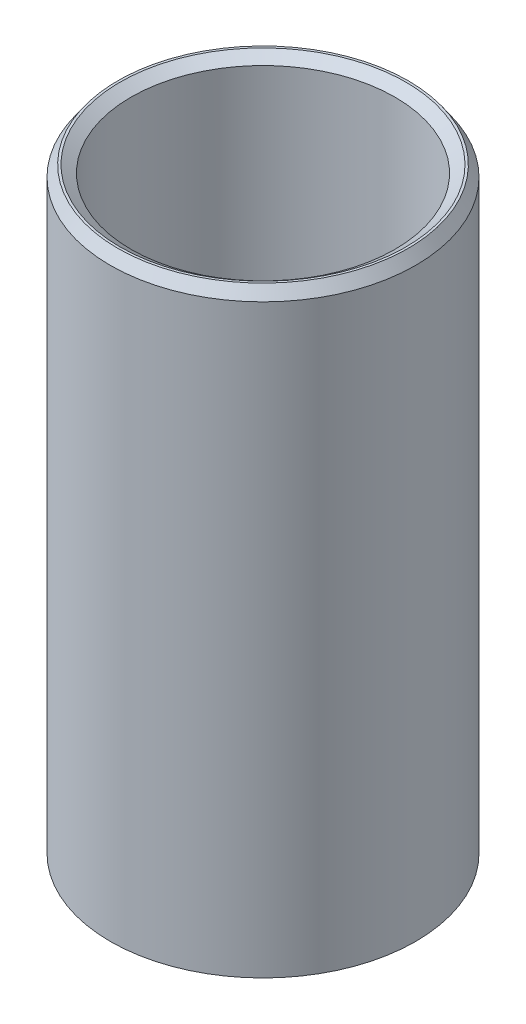
ISO-10303-21;
HEADER;
FILE_DESCRIPTION(('STEP AP214'),'2;1');
FILE_NAME('part.step','',(''),(''),'','','');
FILE_SCHEMA(('AUTOMOTIVE_DESIGN { 1 0 10303 214 1 1 1 1 }'));
ENDSEC;
DATA;
#1=APPLICATION_CONTEXT('core data for automotive mechanical design processes');
#2=APPLICATION_PROTOCOL_DEFINITION('international standard','automotive_design',2000,#1);
#3=PRODUCT_CONTEXT('',#1,'mechanical');
#4=PRODUCT('Part','Part','',(#3));
#5=PRODUCT_RELATED_PRODUCT_CATEGORY('part','',(#4));
#6=PRODUCT_DEFINITION_FORMATION('','',#4);
#7=PRODUCT_DEFINITION_CONTEXT('part definition',#1,'design');
#8=PRODUCT_DEFINITION('design','',#6,#7);
#9=PRODUCT_DEFINITION_SHAPE('','',#8);
#10=(LENGTH_UNIT() NAMED_UNIT(*) SI_UNIT(.MILLI.,.METRE.));
#11=(NAMED_UNIT(*) PLANE_ANGLE_UNIT() SI_UNIT($,.RADIAN.));
#12=(NAMED_UNIT(*) SI_UNIT($,.STERADIAN.) SOLID_ANGLE_UNIT());
#13=UNCERTAINTY_MEASURE_WITH_UNIT(LENGTH_MEASURE(1.E-05),#10,'distance_accuracy_value','');
#14=(GEOMETRIC_REPRESENTATION_CONTEXT(3) GLOBAL_UNCERTAINTY_ASSIGNED_CONTEXT((#13)) GLOBAL_UNIT_ASSIGNED_CONTEXT((#10,
#11,#12)) REPRESENTATION_CONTEXT('',''));
#15=CARTESIAN_POINT('',(0.,0.,0.));
#16=DIRECTION('',(0.,0.,1.));
#17=DIRECTION('',(1.,0.,0.));
#18=AXIS2_PLACEMENT_3D('',#15,#16,#17);
#19=CARTESIAN_POINT('',(0.,217.49006375391,0.));
#20=DIRECTION('',(0.,-1.,0.));
#21=DIRECTION('',(0.,0.,-1.));
#22=AXIS2_PLACEMENT_3D('',#19,#20,#21);
#23=CYLINDRICAL_SURFACE('',#22,55.);
#24=CARTESIAN_POINT('',(0.,2.7091569463687,0.));
#25=DIRECTION('',(0.,1.,0.));
#26=DIRECTION('',(0.,0.,1.));
#27=AXIS2_PLACEMENT_3D('',#24,#25,#26);
#28=CIRCLE('',#27,55.);
#29=CARTESIAN_POINT('',(0.,2.70915694636867,-55.));
#30=VERTEX_POINT('',#29);
#31=EDGE_CURVE('E10',#30,#30,#28,.T.);
#32=CARTESIAN_POINT('',(0.,213.551168218493,0.));
#33=DIRECTION('',(0.,1.,0.));
#34=DIRECTION('',(0.,0.,1.));
#35=AXIS2_PLACEMENT_3D('',#32,#33,#34);
#36=CIRCLE('',#35,55.);
#37=CARTESIAN_POINT('',(0.,213.551168218493,-55.));
#38=VERTEX_POINT('',#37);
#39=EDGE_CURVE('E50',#38,#38,#36,.F.);
#40=CARTESIAN_POINT('',(0.,2.70915694636867,-55.));
#41=CARTESIAN_POINT('',(0.,4.90542789711996,-55.));
#42=CARTESIAN_POINT('',(0.,7.10169884787125,-55.));
#43=CARTESIAN_POINT('',(0.,11.4942407493738,-55.));
#44=CARTESIAN_POINT('',(0.,13.6905117001252,-55.));
#45=CARTESIAN_POINT('',(0.,18.0830536016277,-55.));
#46=CARTESIAN_POINT('',(0.,20.279324552379,-55.));
#47=CARTESIAN_POINT('',(0.,24.6718664538816,-55.));
#48=CARTESIAN_POINT('',(0.,26.8681374046329,-55.));
#49=CARTESIAN_POINT('',(0.,31.2606793061355,-55.));
#50=CARTESIAN_POINT('',(0.,33.4569502568868,-55.));
#51=CARTESIAN_POINT('',(0.,37.8494921583894,-55.));
#52=CARTESIAN_POINT('',(0.,40.0457631091407,-55.));
#53=CARTESIAN_POINT('',(0.,44.4383050106433,-55.));
#54=CARTESIAN_POINT('',(0.,46.6345759613946,-55.));
#55=CARTESIAN_POINT('',(0.,51.0271178628972,-55.));
#56=CARTESIAN_POINT('',(0.,53.2233888136485,-55.));
#57=CARTESIAN_POINT('',(0.,57.6159307151511,-55.));
#58=CARTESIAN_POINT('',(0.,59.8122016659024,-55.));
#59=CARTESIAN_POINT('',(0.,64.2047435674049,-55.));
#60=CARTESIAN_POINT('',(0.,66.4010145181563,-55.));
#61=CARTESIAN_POINT('',(0.,70.7935564196589,-55.));
#62=CARTESIAN_POINT('',(0.,72.9898273704101,-55.));
#63=CARTESIAN_POINT('',(0.,77.3823692719127,-55.));
#64=CARTESIAN_POINT('',(0.,79.578640222664,-55.));
#65=CARTESIAN_POINT('',(0.,83.9711821241666,-55.));
#66=CARTESIAN_POINT('',(0.,86.1674530749179,-55.));
#67=CARTESIAN_POINT('',(0.,90.5599949764205,-55.));
#68=CARTESIAN_POINT('',(0.,92.7562659271718,-55.));
#69=CARTESIAN_POINT('',(0.,97.1488078286744,-55.));
#70=CARTESIAN_POINT('',(0.,99.3450787794257,-55.));
#71=CARTESIAN_POINT('',(0.,103.737620680928,-55.));
#72=CARTESIAN_POINT('',(0.,105.93389163168,-55.));
#73=CARTESIAN_POINT('',(0.,110.326433533182,-55.));
#74=CARTESIAN_POINT('',(0.,112.522704483933,-55.));
#75=CARTESIAN_POINT('',(0.,116.915246385436,-55.));
#76=CARTESIAN_POINT('',(0.,119.111517336187,-55.));
#77=CARTESIAN_POINT('',(0.,123.50405923769,-55.));
#78=CARTESIAN_POINT('',(0.,125.700330188441,-55.));
#79=CARTESIAN_POINT('',(0.,130.092872089944,-55.));
#80=CARTESIAN_POINT('',(0.,132.289143040695,-55.));
#81=CARTESIAN_POINT('',(0.,136.681684942198,-55.));
#82=CARTESIAN_POINT('',(0.,138.877955892949,-55.));
#83=CARTESIAN_POINT('',(0.,143.270497794452,-55.));
#84=CARTESIAN_POINT('',(0.,145.466768745203,-55.));
#85=CARTESIAN_POINT('',(0.,149.859310646705,-55.));
#86=CARTESIAN_POINT('',(0.,152.055581597457,-55.));
#87=CARTESIAN_POINT('',(0.,156.448123498959,-55.));
#88=CARTESIAN_POINT('',(0.,158.644394449711,-55.));
#89=CARTESIAN_POINT('',(0.,163.036936351213,-55.));
#90=CARTESIAN_POINT('',(0.,165.233207301965,-55.));
#91=CARTESIAN_POINT('',(0.,169.625749203467,-55.));
#92=CARTESIAN_POINT('',(0.,171.822020154218,-55.));
#93=CARTESIAN_POINT('',(0.,176.214562055721,-55.));
#94=CARTESIAN_POINT('',(0.,178.410833006472,-55.));
#95=CARTESIAN_POINT('',(0.,182.803374907975,-55.));
#96=CARTESIAN_POINT('',(0.,184.999645858726,-55.));
#97=CARTESIAN_POINT('',(0.,189.392187760229,-55.));
#98=CARTESIAN_POINT('',(0.,191.58845871098,-55.));
#99=CARTESIAN_POINT('',(0.,195.981000612483,-55.));
#100=CARTESIAN_POINT('',(0.,198.177271563234,-55.));
#101=CARTESIAN_POINT('',(0.,202.569813464737,-55.));
#102=CARTESIAN_POINT('',(0.,204.766084415488,-55.));
#103=CARTESIAN_POINT('',(0.,209.15862631699,-55.));
#104=CARTESIAN_POINT('',(0.,211.354897267742,-55.));
#105=CARTESIAN_POINT('',(0.,213.551168218493,-55.));
#106=B_SPLINE_CURVE_WITH_KNOTS('',3,(#40,#41,#42,#43,#44,#45,#46,#47,#48,#49,#50,#51,#52,#53,
#54,#55,#56,#57,#58,#59,#60,#61,#62,#63,#64,#65,#66,#67,#68,#69,#70,#71,#72,#73,#74,#75,#76,#77,
#78,#79,#80,#81,#82,#83,#84,#85,#86,#87,#88,#89,#90,#91,#92,#93,#94,#95,#96,#97,#98,#99,#100,
#101,#102,#103,#104,#105),.UNSPECIFIED.,.F.,.F.,(4,2,2,2,2,2,2,2,2,2,2,2,2,2,2,2,2,2,2,2,2,2,2,
2,2,2,2,2,2,2,2,2,4),(0.,6.58881285225388,13.1776257045078,19.7664385567617,26.3552514090155,
32.9440642612694,39.5328771135233,46.1216899657772,52.7105028180311,59.299315670285,
65.8881285225389,72.4769413747928,79.0657542270467,85.6545670793005,92.2433799315544,
98.8321927838083,105.421005636062,112.009818488316,118.59863134057,125.187444192824,
131.776257045078,138.365069897332,144.953882749586,151.542695601839,158.131508454093,
164.720321306347,171.309134158601,177.897947010855,184.486759863109,191.075572715363,
197.664385567617,204.253198419871,210.842011272124),.UNSPECIFIED.);
#107=EDGE_CURVE('BSEAM39',#30,#38,#106,.T.);
#108=ORIENTED_EDGE('',*,*,#31,.T.);
#109=ORIENTED_EDGE('',*,*,#39,.T.);
#110=ORIENTED_EDGE('',*,*,#107,.T.);
#111=ORIENTED_EDGE('',*,*,#107,.F.);
#112=EDGE_LOOP('',(#108,#110,#109,#111));
#113=FACE_BOUND('',#112,.T.);
#114=ADVANCED_FACE('F39',(#113),#23,.T.);
#115=CARTESIAN_POINT('',(0.,217.49006375391,0.));
#116=DIRECTION('',(0.,1.,0.));
#117=DIRECTION('',(0.,0.,1.));
#118=AXIS2_PLACEMENT_3D('',#115,#116,#117);
#119=PLANE('',#118);
#120=CARTESIAN_POINT('',(0.,217.49006375391,0.));
#121=DIRECTION('',(0.,1.,0.));
#122=DIRECTION('',(0.,0.,1.));
#123=AXIS2_PLACEMENT_3D('',#120,#121,#122);
#124=CIRCLE('',#123,51.4443762123566);
#125=CARTESIAN_POINT('',(0.,217.49006375391,51.4443762123566));
#126=VERTEX_POINT('',#125);
#127=EDGE_CURVE('E58',#126,#126,#124,.F.);
#128=ORIENTED_EDGE('',*,*,#127,.T.);
#129=EDGE_LOOP('',(#128));
#130=FACE_BOUND('',#129,.T.);
#131=CARTESIAN_POINT('',(0.,217.49006375391,0.));
#132=DIRECTION('',(0.,1.,0.));
#133=DIRECTION('',(0.,0.,1.));
#134=AXIS2_PLACEMENT_3D('',#131,#132,#133);
#135=CIRCLE('',#134,52.2908430536315);
#136=CARTESIAN_POINT('',(0.,217.49006375391,52.2908430536315));
#137=VERTEX_POINT('',#136);
#138=EDGE_CURVE('E61',#137,#137,#135,.T.);
#139=ORIENTED_EDGE('',*,*,#138,.T.);
#140=EDGE_LOOP('',(#139));
#141=FACE_BOUND('',#140,.T.);
#142=ADVANCED_FACE('F88',(#130,#141),#119,.T.);
#143=CARTESIAN_POINT('',(0.,0.,0.));
#144=DIRECTION('',(0.,1.,0.));
#145=DIRECTION('',(0.,0.,1.));
#146=AXIS2_PLACEMENT_3D('',#143,#144,#145);
#147=PLANE('',#146);
#148=CARTESIAN_POINT('',(0.,0.,0.));
#149=DIRECTION('',(0.,1.,0.));
#150=DIRECTION('',(0.,0.,1.));
#151=AXIS2_PLACEMENT_3D('',#148,#149,#150);
#152=CIRCLE('',#151,50.2146376233077);
#153=CARTESIAN_POINT('',(0.,0.,50.2146376233077));
#154=VERTEX_POINT('',#153);
#155=EDGE_CURVE('E51',#154,#154,#152,.T.);
#156=ORIENTED_EDGE('',*,*,#155,.T.);
#157=EDGE_LOOP('',(#156));
#158=FACE_BOUND('',#157,.T.);
#159=CARTESIAN_POINT('',(0.,0.,0.));
#160=DIRECTION('',(0.,1.,0.));
#161=DIRECTION('',(0.,0.,1.));
#162=AXIS2_PLACEMENT_3D('',#159,#160,#161);
#163=CIRCLE('',#162,51.0611044645824);
#164=CARTESIAN_POINT('',(0.,0.,51.0611044645824));
#165=VERTEX_POINT('',#164);
#166=EDGE_CURVE('E54',#165,#165,#163,.F.);
#167=ORIENTED_EDGE('',*,*,#166,.T.);
#168=EDGE_LOOP('',(#167));
#169=FACE_BOUND('',#168,.T.);
#170=ADVANCED_FACE('F83',(#158,#169),#147,.F.);
#171=CARTESIAN_POINT('',(0.,217.49006375391,0.));
#172=DIRECTION('',(0.,-1.,0.));
#173=DIRECTION('',(0.,0.,-1.));
#174=AXIS2_PLACEMENT_3D('',#171,#172,#173);
#175=CYLINDRICAL_SURFACE('',#174,47.5054806769391);
#176=CARTESIAN_POINT('',(0.,214.780906807542,0.));
#177=DIRECTION('',(0.,1.,0.));
#178=DIRECTION('',(0.,0.,1.));
#179=AXIS2_PLACEMENT_3D('',#176,#177,#178);
#180=CIRCLE('',#179,47.5054806769391);
#181=CARTESIAN_POINT('',(0.,214.780906807542,-47.5054806769391));
#182=VERTEX_POINT('',#181);
#183=EDGE_CURVE('E67',#182,#182,#180,.T.);
#184=CARTESIAN_POINT('',(0.,3.93889553541737,0.));
#185=DIRECTION('',(0.,1.,0.));
#186=DIRECTION('',(0.,0.,1.));
#187=AXIS2_PLACEMENT_3D('',#184,#185,#186);
#188=CIRCLE('',#187,47.5054806769391);
#189=CARTESIAN_POINT('',(0.,3.93889553541735,-47.5054806769391));
#190=VERTEX_POINT('',#189);
#191=EDGE_CURVE('E69',#190,#190,#188,.F.);
#192=CARTESIAN_POINT('',(0.,214.780906807542,-47.5054806769391));
#193=CARTESIAN_POINT('',(0.,212.58463585679,-47.5054806769391));
#194=CARTESIAN_POINT('',(0.,210.388364906039,-47.5054806769391));
#195=CARTESIAN_POINT('',(0.,205.995823004537,-47.5054806769391));
#196=CARTESIAN_POINT('',(0.,203.799552053785,-47.5054806769391));
#197=CARTESIAN_POINT('',(0.,199.407010152283,-47.5054806769391));
#198=CARTESIAN_POINT('',(0.,197.210739201531,-47.5054806769391));
#199=CARTESIAN_POINT('',(0.,192.818197300029,-47.5054806769391));
#200=CARTESIAN_POINT('',(0.,190.621926349277,-47.5054806769391));
#201=CARTESIAN_POINT('',(0.,186.229384447775,-47.5054806769391));
#202=CARTESIAN_POINT('',(0.,184.033113497024,-47.5054806769391));
#203=CARTESIAN_POINT('',(0.,179.640571595521,-47.5054806769391));
#204=CARTESIAN_POINT('',(0.,177.44430064477,-47.5054806769391));
#205=CARTESIAN_POINT('',(0.,173.051758743267,-47.5054806769391));
#206=CARTESIAN_POINT('',(0.,170.855487792516,-47.5054806769391));
#207=CARTESIAN_POINT('',(0.,166.462945891013,-47.5054806769391));
#208=CARTESIAN_POINT('',(0.,164.266674940262,-47.5054806769391));
#209=CARTESIAN_POINT('',(0.,159.874133038759,-47.5054806769391));
#210=CARTESIAN_POINT('',(0.,157.677862088008,-47.5054806769391));
#211=CARTESIAN_POINT('',(0.,153.285320186505,-47.5054806769391));
#212=CARTESIAN_POINT('',(0.,151.089049235754,-47.5054806769391));
#213=CARTESIAN_POINT('',(0.,146.696507334252,-47.5054806769391));
#214=CARTESIAN_POINT('',(0.,144.5002363835,-47.5054806769391));
#215=CARTESIAN_POINT('',(0.,140.107694481998,-47.5054806769391));
#216=CARTESIAN_POINT('',(0.,137.911423531246,-47.5054806769391));
#217=CARTESIAN_POINT('',(0.,133.518881629744,-47.5054806769391));
#218=CARTESIAN_POINT('',(0.,131.322610678992,-47.5054806769391));
#219=CARTESIAN_POINT('',(0.,126.93006877749,-47.5054806769391));
#220=CARTESIAN_POINT('',(0.,124.733797826739,-47.5054806769391));
#221=CARTESIAN_POINT('',(0.,120.341255925236,-47.5054806769391));
#222=CARTESIAN_POINT('',(0.,118.144984974485,-47.5054806769391));
#223=CARTESIAN_POINT('',(0.,113.752443072982,-47.5054806769391));
#224=CARTESIAN_POINT('',(0.,111.556172122231,-47.5054806769391));
#225=CARTESIAN_POINT('',(0.,107.163630220728,-47.5054806769391));
#226=CARTESIAN_POINT('',(0.,104.967359269977,-47.5054806769391));
#227=CARTESIAN_POINT('',(0.,100.574817368474,-47.5054806769391));
#228=CARTESIAN_POINT('',(0.,98.378546417723,-47.5054806769391));
#229=CARTESIAN_POINT('',(0.,93.9860045162204,-47.5054806769391));
#230=CARTESIAN_POINT('',(0.,91.7897335654692,-47.5054806769391));
#231=CARTESIAN_POINT('',(0.,87.3971916639666,-47.5054806769391));
#232=CARTESIAN_POINT('',(0.,85.2009207132153,-47.5054806769391));
#233=CARTESIAN_POINT('',(0.,80.8083788117127,-47.5054806769391));
#234=CARTESIAN_POINT('',(0.,78.6121078609614,-47.5054806769391));
#235=CARTESIAN_POINT('',(0.,74.2195659594588,-47.5054806769391));
#236=CARTESIAN_POINT('',(0.,72.0232950087075,-47.5054806769391));
#237=CARTESIAN_POINT('',(0.,67.6307531072049,-47.5054806769391));
#238=CARTESIAN_POINT('',(0.,65.4344821564536,-47.5054806769391));
#239=CARTESIAN_POINT('',(0.,61.041940254951,-47.5054806769391));
#240=CARTESIAN_POINT('',(0.,58.8456693041997,-47.5054806769391));
#241=CARTESIAN_POINT('',(0.,54.4531274026971,-47.5054806769391));
#242=CARTESIAN_POINT('',(0.,52.2568564519458,-47.5054806769391));
#243=CARTESIAN_POINT('',(0.,47.8643145504433,-47.5054806769391));
#244=CARTESIAN_POINT('',(0.,45.668043599692,-47.5054806769391));
#245=CARTESIAN_POINT('',(0.,41.2755016981894,-47.5054806769391));
#246=CARTESIAN_POINT('',(0.,39.0792307474381,-47.5054806769391));
#247=CARTESIAN_POINT('',(0.,34.6866888459355,-47.5054806769391));
#248=CARTESIAN_POINT('',(0.,32.4904178951842,-47.5054806769391));
#249=CARTESIAN_POINT('',(0.,28.0978759936816,-47.5054806769391));
#250=CARTESIAN_POINT('',(0.,25.9016050429303,-47.5054806769391));
#251=CARTESIAN_POINT('',(0.,21.5090631414277,-47.5054806769391));
#252=CARTESIAN_POINT('',(0.,19.3127921906764,-47.5054806769391));
#253=CARTESIAN_POINT('',(0.,14.9202502891738,-47.5054806769391));
#254=CARTESIAN_POINT('',(0.,12.7239793384225,-47.5054806769391));
#255=CARTESIAN_POINT('',(0.,8.33143743691993,-47.5054806769391));
#256=CARTESIAN_POINT('',(0.,6.13516648616864,-47.5054806769391));
#257=CARTESIAN_POINT('',(0.,3.93889553541735,-47.5054806769391));
#258=B_SPLINE_CURVE_WITH_KNOTS('',3,(#192,#193,#194,#195,#196,#197,#198,#199,#200,#201,#202,
#203,#204,#205,#206,#207,#208,#209,#210,#211,#212,#213,#214,#215,#216,#217,#218,#219,#220,#221,
#222,#223,#224,#225,#226,#227,#228,#229,#230,#231,#232,#233,#234,#235,#236,#237,#238,#239,#240,
#241,#242,#243,#244,#245,#246,#247,#248,#249,#250,#251,#252,#253,#254,#255,#256,#257),
.UNSPECIFIED.,.F.,.F.,(4,2,2,2,2,2,2,2,2,2,2,2,2,2,2,2,2,2,2,2,2,2,2,2,2,2,2,2,2,2,2,2,4),(0.,
6.58881285225388,13.1776257045078,19.7664385567616,26.3552514090155,32.9440642612694,
39.5328771135233,46.1216899657772,52.7105028180311,59.299315670285,65.8881285225388,
72.4769413747927,79.0657542270466,85.6545670793005,92.2433799315544,98.8321927838083,
105.421005636062,112.009818488316,118.59863134057,125.187444192824,131.776257045078,
138.365069897332,144.953882749585,151.542695601839,158.131508454093,164.720321306347,
171.309134158601,177.897947010855,184.486759863109,191.075572715363,197.664385567617,
204.25319841987,210.842011272124),.UNSPECIFIED.);
#259=EDGE_CURVE('BSEAM71',#182,#190,#258,.T.);
#260=ORIENTED_EDGE('',*,*,#183,.T.);
#261=ORIENTED_EDGE('',*,*,#191,.T.);
#262=ORIENTED_EDGE('',*,*,#259,.T.);
#263=ORIENTED_EDGE('',*,*,#259,.F.);
#264=EDGE_LOOP('',(#260,#262,#261,#263));
#265=FACE_BOUND('',#264,.T.);
#266=ADVANCED_FACE('F71',(#265),#175,.F.);
#267=CARTESIAN_POINT('',(0.,214.780906807542,0.));
#268=DIRECTION('',(0.,1.,0.));
#269=DIRECTION('',(0.,0.,1.));
#270=AXIS2_PLACEMENT_3D('',#267,#268,#269);
#271=CONICAL_SURFACE('',#270,47.5054806769391,0.968307950301049);
#272=ORIENTED_EDGE('',*,*,#127,.F.);
#273=EDGE_LOOP('',(#272));
#274=FACE_BOUND('',#273,.T.);
#275=ORIENTED_EDGE('',*,*,#183,.F.);
#276=EDGE_LOOP('',(#275));
#277=FACE_BOUND('',#276,.T.);
#278=ADVANCED_FACE('F77',(#274,#277),#271,.F.);
#279=CARTESIAN_POINT('',(0.,0.,0.));
#280=DIRECTION('',(0.,-1.,0.));
#281=DIRECTION('',(0.,0.,-1.));
#282=AXIS2_PLACEMENT_3D('',#279,#280,#281);
#283=CONICAL_SURFACE('',#282,50.2146376233077,0.602488376493848);
#284=ORIENTED_EDGE('',*,*,#191,.F.);
#285=EDGE_LOOP('',(#284));
#286=FACE_BOUND('',#285,.T.);
#287=ORIENTED_EDGE('',*,*,#155,.F.);
#288=EDGE_LOOP('',(#287));
#289=FACE_BOUND('',#288,.T.);
#290=ADVANCED_FACE('F73',(#286,#289),#283,.F.);
#291=CARTESIAN_POINT('',(0.,2.7091569463687,0.));
#292=DIRECTION('',(0.,1.,0.));
#293=DIRECTION('',(0.,0.,1.));
#294=AXIS2_PLACEMENT_3D('',#291,#292,#293);
#295=CONICAL_SURFACE('',#294,55.,0.968307950301052);
#296=ORIENTED_EDGE('',*,*,#166,.F.);
#297=EDGE_LOOP('',(#296));
#298=FACE_BOUND('',#297,.T.);
#299=ORIENTED_EDGE('',*,*,#31,.F.);
#300=EDGE_LOOP('',(#299));
#301=FACE_BOUND('',#300,.T.);
#302=ADVANCED_FACE('F76',(#298,#301),#295,.T.);
#303=CARTESIAN_POINT('',(0.,217.49006375391,0.));
#304=DIRECTION('',(0.,-1.,0.));
#305=DIRECTION('',(0.,0.,-1.));
#306=AXIS2_PLACEMENT_3D('',#303,#304,#305);
#307=CONICAL_SURFACE('',#306,52.2908430536315,0.60248837649385);
#308=ORIENTED_EDGE('',*,*,#39,.F.);
#309=EDGE_LOOP('',(#308));
#310=FACE_BOUND('',#309,.T.);
#311=ORIENTED_EDGE('',*,*,#138,.F.);
#312=EDGE_LOOP('',(#311));
#313=FACE_BOUND('',#312,.T.);
#314=ADVANCED_FACE('F45',(#310,#313),#307,.T.);
#315=CLOSED_SHELL('',(#114,#142,#170,#266,#278,#290,#302,#314));
#316=MANIFOLD_SOLID_BREP('B2',#315);
#317=ADVANCED_BREP_SHAPE_REPRESENTATION('',(#18,#316),#14);
#318=SHAPE_DEFINITION_REPRESENTATION(#9,#317);
ENDSEC;
END-ISO-10303-21;
